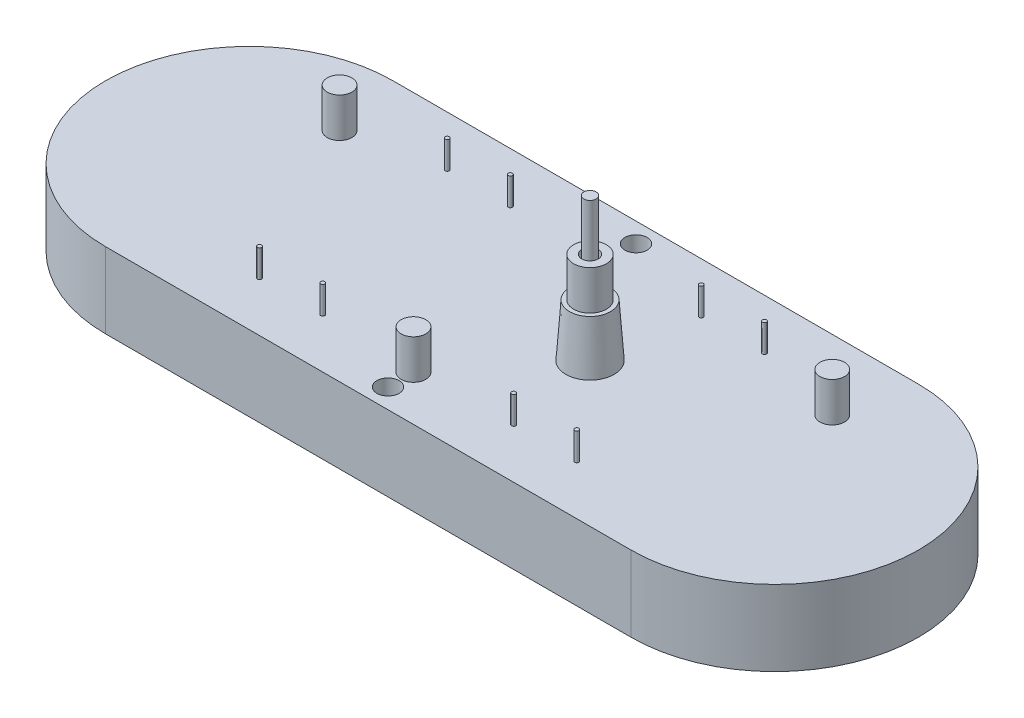
ISO-10303-21;
HEADER;
FILE_DESCRIPTION(('STEP AP214'),'2;1');
FILE_NAME('part.step','',(''),(''),'','','');
FILE_SCHEMA(('AUTOMOTIVE_DESIGN { 1 0 10303 214 1 1 1 1 }'));
ENDSEC;
DATA;
#1=APPLICATION_CONTEXT('core data for automotive mechanical design processes');
#2=APPLICATION_PROTOCOL_DEFINITION('international standard','automotive_design',2000,#1);
#3=PRODUCT_CONTEXT('',#1,'mechanical');
#4=PRODUCT('Part','Part','',(#3));
#5=PRODUCT_RELATED_PRODUCT_CATEGORY('part','',(#4));
#6=PRODUCT_DEFINITION_FORMATION('','',#4);
#7=PRODUCT_DEFINITION_CONTEXT('part definition',#1,'design');
#8=PRODUCT_DEFINITION('design','',#6,#7);
#9=PRODUCT_DEFINITION_SHAPE('','',#8);
#10=(LENGTH_UNIT() NAMED_UNIT(*) SI_UNIT(.MILLI.,.METRE.));
#11=(NAMED_UNIT(*) PLANE_ANGLE_UNIT() SI_UNIT($,.RADIAN.));
#12=(NAMED_UNIT(*) SI_UNIT($,.STERADIAN.) SOLID_ANGLE_UNIT());
#13=UNCERTAINTY_MEASURE_WITH_UNIT(LENGTH_MEASURE(1.E-05),#10,'distance_accuracy_value','');
#14=(GEOMETRIC_REPRESENTATION_CONTEXT(3) GLOBAL_UNCERTAINTY_ASSIGNED_CONTEXT((#13)) GLOBAL_UNIT_ASSIGNED_CONTEXT((#10,
#11,#12)) REPRESENTATION_CONTEXT('',''));
#15=CARTESIAN_POINT('',(0.,0.,0.));
#16=DIRECTION('',(0.,0.,1.));
#17=DIRECTION('',(1.,0.,0.));
#18=AXIS2_PLACEMENT_3D('',#15,#16,#17);
#19=CARTESIAN_POINT('',(-32.,0.,0.));
#20=DIRECTION('',(0.,1.,0.));
#21=DIRECTION('',(0.,0.,1.));
#22=AXIS2_PLACEMENT_3D('',#19,#20,#21);
#23=PLANE('',#22);
#24=CARTESIAN_POINT('',(9.5,0.,0.));
#25=DIRECTION('',(0.,1.,0.));
#26=DIRECTION('',(0.,0.,1.));
#27=AXIS2_PLACEMENT_3D('',#24,#25,#26);
#28=CIRCLE('',#27,1.);
#29=CARTESIAN_POINT('',(9.5,0.,1.));
#30=VERTEX_POINT('',#29);
#31=EDGE_CURVE('E11',#30,#30,#28,.F.);
#32=ORIENTED_EDGE('',*,*,#31,.F.);
#33=EDGE_LOOP('',(#32));
#34=FACE_BOUND('',#33,.T.);
#35=CARTESIAN_POINT('',(9.5,0.,0.));
#36=DIRECTION('',(0.,1.,0.));
#37=DIRECTION('',(0.,0.,1.));
#38=AXIS2_PLACEMENT_3D('',#35,#36,#37);
#39=CIRCLE('',#38,0.750000000000002);
#40=CARTESIAN_POINT('',(9.5,0.,0.750000000000002));
#41=VERTEX_POINT('',#40);
#42=EDGE_CURVE('E117',#41,#41,#39,.T.);
#43=ORIENTED_EDGE('',*,*,#42,.F.);
#44=EDGE_LOOP('',(#43));
#45=FACE_BOUND('',#44,.T.);
#46=ADVANCED_FACE('F38',(#34,#45),#23,.T.);
#47=CARTESIAN_POINT('',(9.5,17.4,0.));
#48=DIRECTION('',(0.,1.,0.));
#49=DIRECTION('',(0.,0.,1.));
#50=AXIS2_PLACEMENT_3D('',#47,#48,#49);
#51=PLANE('',#50);
#52=CARTESIAN_POINT('',(9.5,17.4,0.));
#53=DIRECTION('',(0.,-1.,0.));
#54=DIRECTION('',(0.,0.,-1.));
#55=AXIS2_PLACEMENT_3D('',#52,#53,#54);
#56=CIRCLE('',#55,0.75);
#57=CARTESIAN_POINT('',(9.5,17.4,-0.75));
#58=VERTEX_POINT('',#57);
#59=EDGE_CURVE('E111',#58,#58,#56,.T.);
#60=ORIENTED_EDGE('',*,*,#59,.F.);
#61=EDGE_LOOP('',(#60));
#62=FACE_BOUND('',#61,.T.);
#63=ADVANCED_FACE('F144',(#62),#51,.T.);
#64=CARTESIAN_POINT('',(9.5,0.,0.));
#65=DIRECTION('',(0.,-1.,0.));
#66=DIRECTION('',(0.,0.,-1.));
#67=AXIS2_PLACEMENT_3D('',#64,#65,#66);
#68=CYLINDRICAL_SURFACE('',#67,0.750000000000002);
#69=ORIENTED_EDGE('',*,*,#59,.T.);
#70=EDGE_LOOP('',(#69));
#71=FACE_BOUND('',#70,.T.);
#72=ORIENTED_EDGE('',*,*,#42,.T.);
#73=EDGE_LOOP('',(#72));
#74=FACE_BOUND('',#73,.T.);
#75=ADVANCED_FACE('F149',(#71,#74),#68,.T.);
#76=CARTESIAN_POINT('',(9.5,0.,0.));
#77=DIRECTION('',(0.,-1.,0.));
#78=DIRECTION('',(0.,0.,-1.));
#79=AXIS2_PLACEMENT_3D('',#76,#77,#78);
#80=CYLINDRICAL_SURFACE('',#79,1.);
#81=ORIENTED_EDGE('',*,*,#31,.T.);
#82=EDGE_LOOP('',(#81));
#83=FACE_BOUND('',#82,.T.);
#84=CARTESIAN_POINT('',(9.5,11.2,0.));
#85=DIRECTION('',(0.,-1.,0.));
#86=DIRECTION('',(0.,0.,-1.));
#87=AXIS2_PLACEMENT_3D('',#84,#85,#86);
#88=CIRCLE('',#87,1.);
#89=CARTESIAN_POINT('',(9.5,11.2,-1.));
#90=VERTEX_POINT('',#89);
#91=EDGE_CURVE('E352',#90,#90,#88,.T.);
#92=ORIENTED_EDGE('',*,*,#91,.F.);
#93=EDGE_LOOP('',(#92));
#94=FACE_BOUND('',#93,.T.);
#95=ADVANCED_FACE('F157',(#83,#94),#80,.F.);
#96=CARTESIAN_POINT('',(9.5,0.,0.));
#97=DIRECTION('',(0.,-1.,0.));
#98=DIRECTION('',(0.,0.,-1.));
#99=AXIS2_PLACEMENT_3D('',#96,#97,#98);
#100=CONICAL_SURFACE('',#99,2.94753159643842,0.0698131700797663);
#101=CARTESIAN_POINT('',(9.5,6.4,0.));
#102=DIRECTION('',(0.,-1.,0.));
#103=DIRECTION('',(0.,0.,-1.));
#104=AXIS2_PLACEMENT_3D('',#101,#102,#103);
#105=CIRCLE('',#104,2.5);
#106=CARTESIAN_POINT('',(9.5,6.4,-2.5));
#107=VERTEX_POINT('',#106);
#108=EDGE_CURVE('E363',#107,#107,#105,.T.);
#109=ORIENTED_EDGE('',*,*,#108,.T.);
#110=EDGE_LOOP('',(#109));
#111=FACE_BOUND('',#110,.T.);
#112=CARTESIAN_POINT('',(9.5,0.,0.));
#113=DIRECTION('',(0.,1.,0.));
#114=DIRECTION('',(0.,0.,1.));
#115=AXIS2_PLACEMENT_3D('',#112,#113,#114);
#116=CIRCLE('',#115,2.94753159643842);
#117=CARTESIAN_POINT('',(9.5,0.,2.94753159643842));
#118=VERTEX_POINT('',#117);
#119=EDGE_CURVE('E47',#118,#118,#116,.T.);
#120=ORIENTED_EDGE('',*,*,#119,.T.);
#121=EDGE_LOOP('',(#120));
#122=FACE_BOUND('',#121,.T.);
#123=ADVANCED_FACE('F124',(#111,#122),#100,.T.);
#124=CARTESIAN_POINT('',(9.5,6.4,-2.5));
#125=DIRECTION('',(0.,1.,0.));
#126=DIRECTION('',(0.,0.,1.));
#127=AXIS2_PLACEMENT_3D('',#124,#125,#126);
#128=PLANE('',#127);
#129=CARTESIAN_POINT('',(9.5,6.4,0.));
#130=DIRECTION('',(0.,-1.,0.));
#131=DIRECTION('',(0.,0.,-1.));
#132=AXIS2_PLACEMENT_3D('',#129,#130,#131);
#133=CIRCLE('',#132,2.);
#134=CARTESIAN_POINT('',(9.5,6.4,-2.));
#135=VERTEX_POINT('',#134);
#136=EDGE_CURVE('E360',#135,#135,#133,.T.);
#137=ORIENTED_EDGE('',*,*,#136,.T.);
#138=EDGE_LOOP('',(#137));
#139=FACE_BOUND('',#138,.T.);
#140=ORIENTED_EDGE('',*,*,#108,.F.);
#141=EDGE_LOOP('',(#140));
#142=FACE_BOUND('',#141,.T.);
#143=ADVANCED_FACE('F164',(#139,#142),#128,.T.);
#144=CARTESIAN_POINT('',(9.5,0.,0.));
#145=DIRECTION('',(0.,-1.,0.));
#146=DIRECTION('',(0.,0.,-1.));
#147=AXIS2_PLACEMENT_3D('',#144,#145,#146);
#148=CYLINDRICAL_SURFACE('',#147,2.);
#149=CARTESIAN_POINT('',(9.5,11.2,0.));
#150=DIRECTION('',(0.,-1.,0.));
#151=DIRECTION('',(0.,0.,-1.));
#152=AXIS2_PLACEMENT_3D('',#149,#150,#151);
#153=CIRCLE('',#152,2.);
#154=CARTESIAN_POINT('',(9.5,11.2,-2.));
#155=VERTEX_POINT('',#154);
#156=EDGE_CURVE('E357',#155,#155,#153,.T.);
#157=ORIENTED_EDGE('',*,*,#156,.T.);
#158=EDGE_LOOP('',(#157));
#159=FACE_BOUND('',#158,.T.);
#160=ORIENTED_EDGE('',*,*,#136,.F.);
#161=EDGE_LOOP('',(#160));
#162=FACE_BOUND('',#161,.T.);
#163=ADVANCED_FACE('F168',(#159,#162),#148,.T.);
#164=CARTESIAN_POINT('',(9.5,11.2,-2.));
#165=DIRECTION('',(0.,1.,0.));
#166=DIRECTION('',(0.,0.,1.));
#167=AXIS2_PLACEMENT_3D('',#164,#165,#166);
#168=PLANE('',#167);
#169=ORIENTED_EDGE('',*,*,#91,.T.);
#170=EDGE_LOOP('',(#169));
#171=FACE_BOUND('',#170,.T.);
#172=ORIENTED_EDGE('',*,*,#156,.F.);
#173=EDGE_LOOP('',(#172));
#174=FACE_BOUND('',#173,.T.);
#175=ADVANCED_FACE('F140',(#171,#174),#168,.T.);
#176=CARTESIAN_POINT('',(-32.,-9.2,0.));
#177=DIRECTION('',(0.,1.,0.));
#178=DIRECTION('',(0.,0.,1.));
#179=AXIS2_PLACEMENT_3D('',#176,#177,#178);
#180=PLANE('',#179);
#181=CARTESIAN_POINT('',(0.,-9.2,-15.1));
#182=DIRECTION('',(0.,1.,0.));
#183=DIRECTION('',(0.,0.,1.));
#184=AXIS2_PLACEMENT_3D('',#181,#182,#183);
#185=CIRCLE('',#184,1.35);
#186=CARTESIAN_POINT('',(0.,-9.2,-13.75));
#187=VERTEX_POINT('',#186);
#188=EDGE_CURVE('E275',#187,#187,#185,.T.);
#189=ORIENTED_EDGE('',*,*,#188,.T.);
#190=EDGE_LOOP('',(#189));
#191=FACE_BOUND('',#190,.T.);
#192=CARTESIAN_POINT('',(0.,-9.2,15.1));
#193=DIRECTION('',(0.,1.,0.));
#194=DIRECTION('',(0.,0.,1.));
#195=AXIS2_PLACEMENT_3D('',#192,#193,#194);
#196=CIRCLE('',#195,1.35);
#197=CARTESIAN_POINT('',(0.,-9.2,16.45));
#198=VERTEX_POINT('',#197);
#199=EDGE_CURVE('E279',#198,#198,#196,.T.);
#200=ORIENTED_EDGE('',*,*,#199,.T.);
#201=EDGE_LOOP('',(#200));
#202=FACE_BOUND('',#201,.T.);
#203=CARTESIAN_POINT('',(-32.,-9.2,0.));
#204=DIRECTION('',(0.,1.,0.));
#205=DIRECTION('',(0.,0.,1.));
#206=AXIS2_PLACEMENT_3D('',#203,#204,#205);
#207=CIRCLE('',#206,17.5);
#208=CARTESIAN_POINT('',(-32.,-9.2,-17.5));
#209=VERTEX_POINT('',#208);
#210=CARTESIAN_POINT('',(-32.,-9.2,17.5));
#211=VERTEX_POINT('',#210);
#212=EDGE_CURVE('E100',#209,#211,#207,.T.);
#213=ORIENTED_EDGE('',*,*,#212,.F.);
#214=DIRECTION('',(-1.,0.,0.));
#215=VECTOR('',#214,1.);
#216=CARTESIAN_POINT('',(-32.,-9.2,-17.5));
#217=LINE('',#216,#215);
#218=CARTESIAN_POINT('',(32.,-9.2,-17.5));
#219=VERTEX_POINT('',#218);
#220=EDGE_CURVE('E97',#219,#209,#217,.T.);
#221=ORIENTED_EDGE('',*,*,#220,.F.);
#222=CARTESIAN_POINT('',(32.,-9.2,0.));
#223=DIRECTION('',(0.,1.,0.));
#224=DIRECTION('',(0.,0.,1.));
#225=AXIS2_PLACEMENT_3D('',#222,#223,#224);
#226=CIRCLE('',#225,17.5);
#227=CARTESIAN_POINT('',(32.,-9.2,17.5));
#228=VERTEX_POINT('',#227);
#229=EDGE_CURVE('E89',#228,#219,#226,.T.);
#230=ORIENTED_EDGE('',*,*,#229,.F.);
#231=DIRECTION('',(1.,0.,0.));
#232=VECTOR('',#231,1.);
#233=CARTESIAN_POINT('',(-32.,-9.2,17.5));
#234=LINE('',#233,#232);
#235=EDGE_CURVE('E96',#211,#228,#234,.T.);
#236=ORIENTED_EDGE('',*,*,#235,.F.);
#237=EDGE_LOOP('',(#213,#221,#230,#236));
#238=FACE_BOUND('',#237,.T.);
#239=ADVANCED_FACE('F95',(#191,#202,#238),#180,.F.);
#240=CARTESIAN_POINT('',(-32.,-9.2,-17.5));
#241=DIRECTION('',(0.,0.,-1.));
#242=DIRECTION('',(-1.,0.,0.));
#243=AXIS2_PLACEMENT_3D('',#240,#241,#242);
#244=PLANE('',#243);
#245=DIRECTION('',(-1.,0.,0.));
#246=VECTOR('',#245,1.);
#247=CARTESIAN_POINT('',(-32.,0.,-17.5));
#248=LINE('',#247,#246);
#249=CARTESIAN_POINT('',(32.,0.,-17.5));
#250=VERTEX_POINT('',#249);
#251=CARTESIAN_POINT('',(-32.,0.,-17.5));
#252=VERTEX_POINT('',#251);
#253=EDGE_CURVE('E102',#250,#252,#248,.T.);
#254=ORIENTED_EDGE('',*,*,#253,.F.);
#255=DIRECTION('',(0.,1.,0.));
#256=VECTOR('',#255,1.);
#257=CARTESIAN_POINT('',(32.,-9.2,-17.5));
#258=LINE('',#257,#256);
#259=EDGE_CURVE('E72',#219,#250,#258,.T.);
#260=ORIENTED_EDGE('',*,*,#259,.F.);
#261=ORIENTED_EDGE('',*,*,#220,.T.);
#262=DIRECTION('',(0.,1.,0.));
#263=VECTOR('',#262,1.);
#264=CARTESIAN_POINT('',(-32.,-9.2,-17.5));
#265=LINE('',#264,#263);
#266=EDGE_CURVE('E55',#209,#252,#265,.T.);
#267=ORIENTED_EDGE('',*,*,#266,.T.);
#268=EDGE_LOOP('',(#254,#260,#261,#267));
#269=FACE_BOUND('',#268,.T.);
#270=ADVANCED_FACE('F132',(#269),#244,.T.);
#271=CARTESIAN_POINT('',(32.,-9.2,0.));
#272=DIRECTION('',(0.,1.,0.));
#273=DIRECTION('',(0.,0.,1.));
#274=AXIS2_PLACEMENT_3D('',#271,#272,#273);
#275=CYLINDRICAL_SURFACE('',#274,17.5);
#276=CARTESIAN_POINT('',(32.,0.,0.));
#277=DIRECTION('',(0.,1.,0.));
#278=DIRECTION('',(0.,0.,1.));
#279=AXIS2_PLACEMENT_3D('',#276,#277,#278);
#280=CIRCLE('',#279,17.5);
#281=CARTESIAN_POINT('',(32.,0.,17.5));
#282=VERTEX_POINT('',#281);
#283=EDGE_CURVE('E91',#282,#250,#280,.T.);
#284=ORIENTED_EDGE('',*,*,#283,.F.);
#285=DIRECTION('',(0.,1.,0.));
#286=VECTOR('',#285,1.);
#287=CARTESIAN_POINT('',(32.,-9.2,17.5));
#288=LINE('',#287,#286);
#289=EDGE_CURVE('E86',#228,#282,#288,.T.);
#290=ORIENTED_EDGE('',*,*,#289,.F.);
#291=ORIENTED_EDGE('',*,*,#229,.T.);
#292=ORIENTED_EDGE('',*,*,#259,.T.);
#293=EDGE_LOOP('',(#284,#290,#291,#292));
#294=FACE_BOUND('',#293,.T.);
#295=ADVANCED_FACE('F88',(#294),#275,.T.);
#296=CARTESIAN_POINT('',(-32.,-9.2,17.5));
#297=DIRECTION('',(0.,0.,1.));
#298=DIRECTION('',(1.,0.,0.));
#299=AXIS2_PLACEMENT_3D('',#296,#297,#298);
#300=PLANE('',#299);
#301=DIRECTION('',(1.,0.,0.));
#302=VECTOR('',#301,1.);
#303=CARTESIAN_POINT('',(-32.,0.,17.5));
#304=LINE('',#303,#302);
#305=CARTESIAN_POINT('',(-32.,0.,17.5));
#306=VERTEX_POINT('',#305);
#307=EDGE_CURVE('E110',#306,#282,#304,.T.);
#308=ORIENTED_EDGE('',*,*,#307,.F.);
#309=DIRECTION('',(0.,1.,0.));
#310=VECTOR('',#309,1.);
#311=CARTESIAN_POINT('',(-32.,-9.2,17.5));
#312=LINE('',#311,#310);
#313=EDGE_CURVE('E83',#211,#306,#312,.T.);
#314=ORIENTED_EDGE('',*,*,#313,.F.);
#315=ORIENTED_EDGE('',*,*,#235,.T.);
#316=ORIENTED_EDGE('',*,*,#289,.T.);
#317=EDGE_LOOP('',(#308,#314,#315,#316));
#318=FACE_BOUND('',#317,.T.);
#319=ADVANCED_FACE('F99',(#318),#300,.T.);
#320=CARTESIAN_POINT('',(-32.,-9.2,0.));
#321=DIRECTION('',(0.,1.,0.));
#322=DIRECTION('',(0.,0.,1.));
#323=AXIS2_PLACEMENT_3D('',#320,#321,#322);
#324=CYLINDRICAL_SURFACE('',#323,17.5);
#325=CARTESIAN_POINT('',(-32.,0.,0.));
#326=DIRECTION('',(0.,1.,0.));
#327=DIRECTION('',(0.,0.,1.));
#328=AXIS2_PLACEMENT_3D('',#325,#326,#327);
#329=CIRCLE('',#328,17.5);
#330=EDGE_CURVE('E107',#252,#306,#329,.T.);
#331=ORIENTED_EDGE('',*,*,#330,.F.);
#332=ORIENTED_EDGE('',*,*,#266,.F.);
#333=ORIENTED_EDGE('',*,*,#212,.T.);
#334=ORIENTED_EDGE('',*,*,#313,.T.);
#335=EDGE_LOOP('',(#331,#332,#333,#334));
#336=FACE_BOUND('',#335,.T.);
#337=ADVANCED_FACE('F40',(#336),#324,.T.);
#338=CARTESIAN_POINT('',(0.,0.,-15.1));
#339=DIRECTION('',(0.,1.,0.));
#340=DIRECTION('',(0.,0.,1.));
#341=AXIS2_PLACEMENT_3D('',#338,#339,#340);
#342=CIRCLE('',#341,1.35);
#343=CARTESIAN_POINT('',(0.,0.,-13.75));
#344=VERTEX_POINT('',#343);
#345=EDGE_CURVE('E278',#344,#344,#342,.T.);
#346=ORIENTED_EDGE('',*,*,#345,.F.);
#347=EDGE_LOOP('',(#346));
#348=FACE_BOUND('',#347,.T.);
#349=CARTESIAN_POINT('',(0.,0.,15.1));
#350=DIRECTION('',(0.,1.,0.));
#351=DIRECTION('',(0.,0.,1.));
#352=AXIS2_PLACEMENT_3D('',#349,#350,#351);
#353=CIRCLE('',#352,1.35);
#354=CARTESIAN_POINT('',(0.,0.,16.45));
#355=VERTEX_POINT('',#354);
#356=EDGE_CURVE('E284',#355,#355,#353,.T.);
#357=ORIENTED_EDGE('',*,*,#356,.F.);
#358=EDGE_LOOP('',(#357));
#359=FACE_BOUND('',#358,.T.);
#360=CARTESIAN_POINT('',(19.32,0.,-11.425));
#361=DIRECTION('',(0.,1.,0.));
#362=DIRECTION('',(0.,0.,-1.));
#363=AXIS2_PLACEMENT_3D('',#360,#361,#362);
#364=CIRCLE('',#363,0.25);
#365=CARTESIAN_POINT('',(19.32,0.,-11.675));
#366=VERTEX_POINT('',#365);
#367=EDGE_CURVE('E281',#366,#366,#364,.T.);
#368=ORIENTED_EDGE('',*,*,#367,.F.);
#369=EDGE_LOOP('',(#368));
#370=FACE_BOUND('',#369,.T.);
#371=CARTESIAN_POINT('',(11.62,0.,-11.425));
#372=DIRECTION('',(0.,1.,0.));
#373=DIRECTION('',(0.,0.,-1.));
#374=AXIS2_PLACEMENT_3D('',#371,#372,#373);
#375=CIRCLE('',#374,0.25);
#376=CARTESIAN_POINT('',(11.62,0.,-11.675));
#377=VERTEX_POINT('',#376);
#378=EDGE_CURVE('E292',#377,#377,#375,.T.);
#379=ORIENTED_EDGE('',*,*,#378,.F.);
#380=EDGE_LOOP('',(#379));
#381=FACE_BOUND('',#380,.T.);
#382=CARTESIAN_POINT('',(11.6199999999998,0.,11.425));
#383=DIRECTION('',(0.,1.,0.));
#384=DIRECTION('',(0.,0.,-1.));
#385=AXIS2_PLACEMENT_3D('',#382,#383,#384);
#386=CIRCLE('',#385,0.25);
#387=CARTESIAN_POINT('',(11.6199999999998,0.,11.175));
#388=VERTEX_POINT('',#387);
#389=EDGE_CURVE('E298',#388,#388,#386,.T.);
#390=ORIENTED_EDGE('',*,*,#389,.F.);
#391=EDGE_LOOP('',(#390));
#392=FACE_BOUND('',#391,.T.);
#393=CARTESIAN_POINT('',(19.3199999999998,0.,11.425));
#394=DIRECTION('',(0.,1.,0.));
#395=DIRECTION('',(0.,0.,-1.));
#396=AXIS2_PLACEMENT_3D('',#393,#394,#395);
#397=CIRCLE('',#396,0.25);
#398=CARTESIAN_POINT('',(19.3199999999998,0.,11.175));
#399=VERTEX_POINT('',#398);
#400=EDGE_CURVE('E304',#399,#399,#397,.T.);
#401=ORIENTED_EDGE('',*,*,#400,.F.);
#402=EDGE_LOOP('',(#401));
#403=FACE_BOUND('',#402,.T.);
#404=CARTESIAN_POINT('',(-19.3199999999998,0.,11.425));
#405=DIRECTION('',(0.,1.,0.));
#406=DIRECTION('',(0.,0.,1.));
#407=AXIS2_PLACEMENT_3D('',#404,#405,#406);
#408=CIRCLE('',#407,0.25);
#409=CARTESIAN_POINT('',(-19.3199999999998,0.,11.675));
#410=VERTEX_POINT('',#409);
#411=EDGE_CURVE('E310',#410,#410,#408,.T.);
#412=ORIENTED_EDGE('',*,*,#411,.F.);
#413=EDGE_LOOP('',(#412));
#414=FACE_BOUND('',#413,.T.);
#415=CARTESIAN_POINT('',(-11.6199999999998,0.,11.425));
#416=DIRECTION('',(0.,1.,0.));
#417=DIRECTION('',(0.,0.,1.));
#418=AXIS2_PLACEMENT_3D('',#415,#416,#417);
#419=CIRCLE('',#418,0.25);
#420=CARTESIAN_POINT('',(-11.6199999999998,0.,11.675));
#421=VERTEX_POINT('',#420);
#422=EDGE_CURVE('E316',#421,#421,#419,.T.);
#423=ORIENTED_EDGE('',*,*,#422,.F.);
#424=EDGE_LOOP('',(#423));
#425=FACE_BOUND('',#424,.T.);
#426=CARTESIAN_POINT('',(-11.62,0.,-11.425));
#427=DIRECTION('',(0.,1.,0.));
#428=DIRECTION('',(0.,0.,1.));
#429=AXIS2_PLACEMENT_3D('',#426,#427,#428);
#430=CIRCLE('',#429,0.25);
#431=CARTESIAN_POINT('',(-11.62,0.,-11.175));
#432=VERTEX_POINT('',#431);
#433=EDGE_CURVE('E322',#432,#432,#430,.T.);
#434=ORIENTED_EDGE('',*,*,#433,.F.);
#435=EDGE_LOOP('',(#434));
#436=FACE_BOUND('',#435,.T.);
#437=CARTESIAN_POINT('',(-19.32,0.,-11.425));
#438=DIRECTION('',(0.,1.,0.));
#439=DIRECTION('',(0.,0.,1.));
#440=AXIS2_PLACEMENT_3D('',#437,#438,#439);
#441=CIRCLE('',#440,0.25);
#442=CARTESIAN_POINT('',(-19.32,0.,-11.175));
#443=VERTEX_POINT('',#442);
#444=EDGE_CURVE('E328',#443,#443,#441,.T.);
#445=ORIENTED_EDGE('',*,*,#444,.F.);
#446=EDGE_LOOP('',(#445));
#447=FACE_BOUND('',#446,.T.);
#448=CARTESIAN_POINT('',(-30.,0.,-9.));
#449=DIRECTION('',(0.,1.,0.));
#450=DIRECTION('',(0.,0.,-1.));
#451=AXIS2_PLACEMENT_3D('',#448,#449,#450);
#452=CIRCLE('',#451,1.50000000000001);
#453=CARTESIAN_POINT('',(-30.,0.,-10.5));
#454=VERTEX_POINT('',#453);
#455=EDGE_CURVE('E334',#454,#454,#452,.T.);
#456=ORIENTED_EDGE('',*,*,#455,.F.);
#457=EDGE_LOOP('',(#456));
#458=FACE_BOUND('',#457,.T.);
#459=CARTESIAN_POINT('',(30.,0.,-9.));
#460=DIRECTION('',(0.,1.,0.));
#461=DIRECTION('',(0.,0.,1.));
#462=AXIS2_PLACEMENT_3D('',#459,#460,#461);
#463=CIRCLE('',#462,1.50000000000001);
#464=CARTESIAN_POINT('',(30.,0.,-7.49999999999999));
#465=VERTEX_POINT('',#464);
#466=EDGE_CURVE('E340',#465,#465,#463,.T.);
#467=ORIENTED_EDGE('',*,*,#466,.F.);
#468=EDGE_LOOP('',(#467));
#469=FACE_BOUND('',#468,.T.);
#470=CARTESIAN_POINT('',(0.,0.,12.));
#471=DIRECTION('',(0.,1.,0.));
#472=DIRECTION('',(0.,0.,1.));
#473=AXIS2_PLACEMENT_3D('',#470,#471,#472);
#474=CIRCLE('',#473,1.5);
#475=CARTESIAN_POINT('',(0.,0.,13.5));
#476=VERTEX_POINT('',#475);
#477=EDGE_CURVE('E346',#476,#476,#474,.T.);
#478=ORIENTED_EDGE('',*,*,#477,.F.);
#479=EDGE_LOOP('',(#478));
#480=FACE_BOUND('',#479,.T.);
#481=ORIENTED_EDGE('',*,*,#119,.F.);
#482=EDGE_LOOP('',(#481));
#483=FACE_BOUND('',#482,.T.);
#484=ORIENTED_EDGE('',*,*,#330,.T.);
#485=ORIENTED_EDGE('',*,*,#307,.T.);
#486=ORIENTED_EDGE('',*,*,#283,.T.);
#487=ORIENTED_EDGE('',*,*,#253,.T.);
#488=EDGE_LOOP('',(#484,#485,#486,#487));
#489=FACE_BOUND('',#488,.T.);
#490=ADVANCED_FACE('F126',(#348,#359,#370,#381,#392,#403,#414,#425,#436,#447,#458,#469,#480,
#483,#489),#23,.T.);
#491=CARTESIAN_POINT('',(0.,4.8,12.));
#492=DIRECTION('',(0.,-1.,0.));
#493=DIRECTION('',(0.,0.,-1.));
#494=AXIS2_PLACEMENT_3D('',#491,#492,#493);
#495=CYLINDRICAL_SURFACE('',#494,1.5);
#496=CARTESIAN_POINT('',(0.,4.8,12.));
#497=DIRECTION('',(0.,1.,0.));
#498=DIRECTION('',(0.,0.,1.));
#499=AXIS2_PLACEMENT_3D('',#496,#497,#498);
#500=CIRCLE('',#499,1.5);
#501=CARTESIAN_POINT('',(0.,4.8,13.5));
#502=VERTEX_POINT('',#501);
#503=EDGE_CURVE('E349',#502,#502,#500,.T.);
#504=ORIENTED_EDGE('',*,*,#503,.F.);
#505=EDGE_LOOP('',(#504));
#506=FACE_BOUND('',#505,.T.);
#507=ORIENTED_EDGE('',*,*,#477,.T.);
#508=EDGE_LOOP('',(#507));
#509=FACE_BOUND('',#508,.T.);
#510=ADVANCED_FACE('F129',(#506,#509),#495,.T.);
#511=CARTESIAN_POINT('',(0.,4.8,12.));
#512=DIRECTION('',(0.,1.,0.));
#513=DIRECTION('',(0.,0.,1.));
#514=AXIS2_PLACEMENT_3D('',#511,#512,#513);
#515=PLANE('',#514);
#516=ORIENTED_EDGE('',*,*,#503,.T.);
#517=EDGE_LOOP('',(#516));
#518=FACE_BOUND('',#517,.T.);
#519=ADVANCED_FACE('F178',(#518),#515,.T.);
#520=CARTESIAN_POINT('',(30.,4.8,-9.));
#521=DIRECTION('',(0.,-1.,0.));
#522=DIRECTION('',(0.,0.,-1.));
#523=AXIS2_PLACEMENT_3D('',#520,#521,#522);
#524=CYLINDRICAL_SURFACE('',#523,1.50000000000001);
#525=CARTESIAN_POINT('',(30.,4.8,-9.));
#526=DIRECTION('',(0.,1.,0.));
#527=DIRECTION('',(0.,0.,1.));
#528=AXIS2_PLACEMENT_3D('',#525,#526,#527);
#529=CIRCLE('',#528,1.50000000000001);
#530=CARTESIAN_POINT('',(30.,4.8,-7.49999999999999));
#531=VERTEX_POINT('',#530);
#532=EDGE_CURVE('E343',#531,#531,#529,.T.);
#533=ORIENTED_EDGE('',*,*,#532,.F.);
#534=EDGE_LOOP('',(#533));
#535=FACE_BOUND('',#534,.T.);
#536=ORIENTED_EDGE('',*,*,#466,.T.);
#537=EDGE_LOOP('',(#536));
#538=FACE_BOUND('',#537,.T.);
#539=ADVANCED_FACE('F182',(#535,#538),#524,.T.);
#540=CARTESIAN_POINT('',(30.,4.8,-9.));
#541=DIRECTION('',(0.,1.,0.));
#542=DIRECTION('',(0.,0.,1.));
#543=AXIS2_PLACEMENT_3D('',#540,#541,#542);
#544=PLANE('',#543);
#545=ORIENTED_EDGE('',*,*,#532,.T.);
#546=EDGE_LOOP('',(#545));
#547=FACE_BOUND('',#546,.T.);
#548=ADVANCED_FACE('F186',(#547),#544,.T.);
#549=CARTESIAN_POINT('',(-30.,4.8,-9.));
#550=DIRECTION('',(0.,-1.,0.));
#551=DIRECTION('',(0.,0.,-1.));
#552=AXIS2_PLACEMENT_3D('',#549,#550,#551);
#553=CYLINDRICAL_SURFACE('',#552,1.50000000000001);
#554=CARTESIAN_POINT('',(-30.,4.8,-9.));
#555=DIRECTION('',(0.,1.,0.));
#556=DIRECTION('',(0.,0.,-1.));
#557=AXIS2_PLACEMENT_3D('',#554,#555,#556);
#558=CIRCLE('',#557,1.50000000000001);
#559=CARTESIAN_POINT('',(-30.,4.8,-10.5));
#560=VERTEX_POINT('',#559);
#561=EDGE_CURVE('E337',#560,#560,#558,.T.);
#562=ORIENTED_EDGE('',*,*,#561,.F.);
#563=EDGE_LOOP('',(#562));
#564=FACE_BOUND('',#563,.T.);
#565=ORIENTED_EDGE('',*,*,#455,.T.);
#566=EDGE_LOOP('',(#565));
#567=FACE_BOUND('',#566,.T.);
#568=ADVANCED_FACE('F190',(#564,#567),#553,.T.);
#569=CARTESIAN_POINT('',(-30.,4.8,-9.));
#570=DIRECTION('',(0.,-1.,0.));
#571=DIRECTION('',(0.,0.,-1.));
#572=AXIS2_PLACEMENT_3D('',#569,#570,#571);
#573=PLANE('',#572);
#574=ORIENTED_EDGE('',*,*,#561,.T.);
#575=EDGE_LOOP('',(#574));
#576=FACE_BOUND('',#575,.T.);
#577=ADVANCED_FACE('F194',(#576),#573,.F.);
#578=CARTESIAN_POINT('',(-19.32,3.35,-11.425));
#579=DIRECTION('',(0.,-1.,0.));
#580=DIRECTION('',(0.,0.,-1.));
#581=AXIS2_PLACEMENT_3D('',#578,#579,#580);
#582=CYLINDRICAL_SURFACE('',#581,0.25);
#583=CARTESIAN_POINT('',(-19.32,3.35,-11.425));
#584=DIRECTION('',(0.,1.,0.));
#585=DIRECTION('',(0.,0.,1.));
#586=AXIS2_PLACEMENT_3D('',#583,#584,#585);
#587=CIRCLE('',#586,0.25);
#588=CARTESIAN_POINT('',(-19.32,3.35,-11.175));
#589=VERTEX_POINT('',#588);
#590=EDGE_CURVE('E331',#589,#589,#587,.T.);
#591=ORIENTED_EDGE('',*,*,#590,.F.);
#592=EDGE_LOOP('',(#591));
#593=FACE_BOUND('',#592,.T.);
#594=ORIENTED_EDGE('',*,*,#444,.T.);
#595=EDGE_LOOP('',(#594));
#596=FACE_BOUND('',#595,.T.);
#597=ADVANCED_FACE('F198',(#593,#596),#582,.T.);
#598=CARTESIAN_POINT('',(-19.32,3.35,-11.425));
#599=DIRECTION('',(0.,1.,0.));
#600=DIRECTION('',(0.,0.,1.));
#601=AXIS2_PLACEMENT_3D('',#598,#599,#600);
#602=PLANE('',#601);
#603=ORIENTED_EDGE('',*,*,#590,.T.);
#604=EDGE_LOOP('',(#603));
#605=FACE_BOUND('',#604,.T.);
#606=ADVANCED_FACE('F202',(#605),#602,.T.);
#607=CARTESIAN_POINT('',(-11.62,3.35,-11.425));
#608=DIRECTION('',(0.,-1.,0.));
#609=DIRECTION('',(0.,0.,-1.));
#610=AXIS2_PLACEMENT_3D('',#607,#608,#609);
#611=CYLINDRICAL_SURFACE('',#610,0.25);
#612=CARTESIAN_POINT('',(-11.62,3.35,-11.425));
#613=DIRECTION('',(0.,1.,0.));
#614=DIRECTION('',(0.,0.,1.));
#615=AXIS2_PLACEMENT_3D('',#612,#613,#614);
#616=CIRCLE('',#615,0.25);
#617=CARTESIAN_POINT('',(-11.62,3.35,-11.175));
#618=VERTEX_POINT('',#617);
#619=EDGE_CURVE('E325',#618,#618,#616,.T.);
#620=ORIENTED_EDGE('',*,*,#619,.F.);
#621=EDGE_LOOP('',(#620));
#622=FACE_BOUND('',#621,.T.);
#623=ORIENTED_EDGE('',*,*,#433,.T.);
#624=EDGE_LOOP('',(#623));
#625=FACE_BOUND('',#624,.T.);
#626=ADVANCED_FACE('F206',(#622,#625),#611,.T.);
#627=CARTESIAN_POINT('',(-11.62,3.35,-11.425));
#628=DIRECTION('',(0.,1.,0.));
#629=DIRECTION('',(0.,0.,1.));
#630=AXIS2_PLACEMENT_3D('',#627,#628,#629);
#631=PLANE('',#630);
#632=ORIENTED_EDGE('',*,*,#619,.T.);
#633=EDGE_LOOP('',(#632));
#634=FACE_BOUND('',#633,.T.);
#635=ADVANCED_FACE('F210',(#634),#631,.T.);
#636=CARTESIAN_POINT('',(-11.6199999999998,3.35,11.425));
#637=DIRECTION('',(0.,-1.,0.));
#638=DIRECTION('',(0.,0.,-1.));
#639=AXIS2_PLACEMENT_3D('',#636,#637,#638);
#640=CYLINDRICAL_SURFACE('',#639,0.25);
#641=CARTESIAN_POINT('',(-11.6199999999998,3.35,11.425));
#642=DIRECTION('',(0.,1.,0.));
#643=DIRECTION('',(0.,0.,1.));
#644=AXIS2_PLACEMENT_3D('',#641,#642,#643);
#645=CIRCLE('',#644,0.25);
#646=CARTESIAN_POINT('',(-11.6199999999998,3.35,11.675));
#647=VERTEX_POINT('',#646);
#648=EDGE_CURVE('E319',#647,#647,#645,.T.);
#649=ORIENTED_EDGE('',*,*,#648,.F.);
#650=EDGE_LOOP('',(#649));
#651=FACE_BOUND('',#650,.T.);
#652=ORIENTED_EDGE('',*,*,#422,.T.);
#653=EDGE_LOOP('',(#652));
#654=FACE_BOUND('',#653,.T.);
#655=ADVANCED_FACE('F214',(#651,#654),#640,.T.);
#656=CARTESIAN_POINT('',(-11.6199999999998,3.35,11.425));
#657=DIRECTION('',(0.,1.,0.));
#658=DIRECTION('',(0.,0.,1.));
#659=AXIS2_PLACEMENT_3D('',#656,#657,#658);
#660=PLANE('',#659);
#661=ORIENTED_EDGE('',*,*,#648,.T.);
#662=EDGE_LOOP('',(#661));
#663=FACE_BOUND('',#662,.T.);
#664=ADVANCED_FACE('F218',(#663),#660,.T.);
#665=CARTESIAN_POINT('',(-19.3199999999998,3.35,11.425));
#666=DIRECTION('',(0.,-1.,0.));
#667=DIRECTION('',(0.,0.,-1.));
#668=AXIS2_PLACEMENT_3D('',#665,#666,#667);
#669=CYLINDRICAL_SURFACE('',#668,0.25);
#670=CARTESIAN_POINT('',(-19.3199999999998,3.35,11.425));
#671=DIRECTION('',(0.,1.,0.));
#672=DIRECTION('',(0.,0.,1.));
#673=AXIS2_PLACEMENT_3D('',#670,#671,#672);
#674=CIRCLE('',#673,0.25);
#675=CARTESIAN_POINT('',(-19.3199999999998,3.35,11.675));
#676=VERTEX_POINT('',#675);
#677=EDGE_CURVE('E313',#676,#676,#674,.T.);
#678=ORIENTED_EDGE('',*,*,#677,.F.);
#679=EDGE_LOOP('',(#678));
#680=FACE_BOUND('',#679,.T.);
#681=ORIENTED_EDGE('',*,*,#411,.T.);
#682=EDGE_LOOP('',(#681));
#683=FACE_BOUND('',#682,.T.);
#684=ADVANCED_FACE('F222',(#680,#683),#669,.T.);
#685=CARTESIAN_POINT('',(-19.3199999999998,3.35,11.425));
#686=DIRECTION('',(0.,1.,0.));
#687=DIRECTION('',(0.,0.,1.));
#688=AXIS2_PLACEMENT_3D('',#685,#686,#687);
#689=PLANE('',#688);
#690=ORIENTED_EDGE('',*,*,#677,.T.);
#691=EDGE_LOOP('',(#690));
#692=FACE_BOUND('',#691,.T.);
#693=ADVANCED_FACE('F226',(#692),#689,.T.);
#694=CARTESIAN_POINT('',(19.3199999999998,3.35,11.425));
#695=DIRECTION('',(0.,-1.,0.));
#696=DIRECTION('',(0.,0.,-1.));
#697=AXIS2_PLACEMENT_3D('',#694,#695,#696);
#698=CYLINDRICAL_SURFACE('',#697,0.25);
#699=CARTESIAN_POINT('',(19.3199999999998,3.35,11.425));
#700=DIRECTION('',(0.,1.,0.));
#701=DIRECTION('',(0.,0.,-1.));
#702=AXIS2_PLACEMENT_3D('',#699,#700,#701);
#703=CIRCLE('',#702,0.25);
#704=CARTESIAN_POINT('',(19.3199999999998,3.35,11.175));
#705=VERTEX_POINT('',#704);
#706=EDGE_CURVE('E307',#705,#705,#703,.T.);
#707=ORIENTED_EDGE('',*,*,#706,.F.);
#708=EDGE_LOOP('',(#707));
#709=FACE_BOUND('',#708,.T.);
#710=ORIENTED_EDGE('',*,*,#400,.T.);
#711=EDGE_LOOP('',(#710));
#712=FACE_BOUND('',#711,.T.);
#713=ADVANCED_FACE('F230',(#709,#712),#698,.T.);
#714=CARTESIAN_POINT('',(19.3199999999998,3.35,11.425));
#715=DIRECTION('',(0.,-1.,0.));
#716=DIRECTION('',(0.,0.,-1.));
#717=AXIS2_PLACEMENT_3D('',#714,#715,#716);
#718=PLANE('',#717);
#719=ORIENTED_EDGE('',*,*,#706,.T.);
#720=EDGE_LOOP('',(#719));
#721=FACE_BOUND('',#720,.T.);
#722=ADVANCED_FACE('F234',(#721),#718,.F.);
#723=CARTESIAN_POINT('',(11.6199999999998,3.35,11.425));
#724=DIRECTION('',(0.,-1.,0.));
#725=DIRECTION('',(0.,0.,-1.));
#726=AXIS2_PLACEMENT_3D('',#723,#724,#725);
#727=CYLINDRICAL_SURFACE('',#726,0.25);
#728=CARTESIAN_POINT('',(11.6199999999998,3.35,11.425));
#729=DIRECTION('',(0.,1.,0.));
#730=DIRECTION('',(0.,0.,-1.));
#731=AXIS2_PLACEMENT_3D('',#728,#729,#730);
#732=CIRCLE('',#731,0.25);
#733=CARTESIAN_POINT('',(11.6199999999998,3.35,11.175));
#734=VERTEX_POINT('',#733);
#735=EDGE_CURVE('E301',#734,#734,#732,.T.);
#736=ORIENTED_EDGE('',*,*,#735,.F.);
#737=EDGE_LOOP('',(#736));
#738=FACE_BOUND('',#737,.T.);
#739=ORIENTED_EDGE('',*,*,#389,.T.);
#740=EDGE_LOOP('',(#739));
#741=FACE_BOUND('',#740,.T.);
#742=ADVANCED_FACE('F238',(#738,#741),#727,.T.);
#743=CARTESIAN_POINT('',(11.6199999999998,3.35,11.425));
#744=DIRECTION('',(0.,-1.,0.));
#745=DIRECTION('',(0.,0.,-1.));
#746=AXIS2_PLACEMENT_3D('',#743,#744,#745);
#747=PLANE('',#746);
#748=ORIENTED_EDGE('',*,*,#735,.T.);
#749=EDGE_LOOP('',(#748));
#750=FACE_BOUND('',#749,.T.);
#751=ADVANCED_FACE('F242',(#750),#747,.F.);
#752=CARTESIAN_POINT('',(11.62,3.35,-11.425));
#753=DIRECTION('',(0.,-1.,0.));
#754=DIRECTION('',(0.,0.,-1.));
#755=AXIS2_PLACEMENT_3D('',#752,#753,#754);
#756=CYLINDRICAL_SURFACE('',#755,0.25);
#757=CARTESIAN_POINT('',(11.62,3.35,-11.425));
#758=DIRECTION('',(0.,1.,0.));
#759=DIRECTION('',(0.,0.,-1.));
#760=AXIS2_PLACEMENT_3D('',#757,#758,#759);
#761=CIRCLE('',#760,0.25);
#762=CARTESIAN_POINT('',(11.62,3.35,-11.675));
#763=VERTEX_POINT('',#762);
#764=EDGE_CURVE('E295',#763,#763,#761,.T.);
#765=ORIENTED_EDGE('',*,*,#764,.F.);
#766=EDGE_LOOP('',(#765));
#767=FACE_BOUND('',#766,.T.);
#768=ORIENTED_EDGE('',*,*,#378,.T.);
#769=EDGE_LOOP('',(#768));
#770=FACE_BOUND('',#769,.T.);
#771=ADVANCED_FACE('F246',(#767,#770),#756,.T.);
#772=CARTESIAN_POINT('',(11.62,3.35,-11.425));
#773=DIRECTION('',(0.,-1.,0.));
#774=DIRECTION('',(0.,0.,-1.));
#775=AXIS2_PLACEMENT_3D('',#772,#773,#774);
#776=PLANE('',#775);
#777=ORIENTED_EDGE('',*,*,#764,.T.);
#778=EDGE_LOOP('',(#777));
#779=FACE_BOUND('',#778,.T.);
#780=ADVANCED_FACE('F250',(#779),#776,.F.);
#781=CARTESIAN_POINT('',(19.32,3.35,-11.425));
#782=DIRECTION('',(0.,-1.,0.));
#783=DIRECTION('',(0.,0.,-1.));
#784=AXIS2_PLACEMENT_3D('',#781,#782,#783);
#785=CYLINDRICAL_SURFACE('',#784,0.25);
#786=CARTESIAN_POINT('',(19.32,3.35,-11.425));
#787=DIRECTION('',(0.,1.,0.));
#788=DIRECTION('',(0.,0.,-1.));
#789=AXIS2_PLACEMENT_3D('',#786,#787,#788);
#790=CIRCLE('',#789,0.25);
#791=CARTESIAN_POINT('',(19.32,3.35,-11.675));
#792=VERTEX_POINT('',#791);
#793=EDGE_CURVE('E289',#792,#792,#790,.T.);
#794=ORIENTED_EDGE('',*,*,#793,.F.);
#795=EDGE_LOOP('',(#794));
#796=FACE_BOUND('',#795,.T.);
#797=ORIENTED_EDGE('',*,*,#367,.T.);
#798=EDGE_LOOP('',(#797));
#799=FACE_BOUND('',#798,.T.);
#800=ADVANCED_FACE('F254',(#796,#799),#785,.T.);
#801=CARTESIAN_POINT('',(19.32,3.35,-11.425));
#802=DIRECTION('',(0.,-1.,0.));
#803=DIRECTION('',(0.,0.,-1.));
#804=AXIS2_PLACEMENT_3D('',#801,#802,#803);
#805=PLANE('',#804);
#806=ORIENTED_EDGE('',*,*,#793,.T.);
#807=EDGE_LOOP('',(#806));
#808=FACE_BOUND('',#807,.T.);
#809=ADVANCED_FACE('F258',(#808),#805,.F.);
#810=CARTESIAN_POINT('',(0.,-9.2,15.1));
#811=DIRECTION('',(0.,1.,0.));
#812=DIRECTION('',(0.,0.,1.));
#813=AXIS2_PLACEMENT_3D('',#810,#811,#812);
#814=CYLINDRICAL_SURFACE('',#813,1.35);
#815=ORIENTED_EDGE('',*,*,#199,.F.);
#816=EDGE_LOOP('',(#815));
#817=FACE_BOUND('',#816,.T.);
#818=ORIENTED_EDGE('',*,*,#356,.T.);
#819=EDGE_LOOP('',(#818));
#820=FACE_BOUND('',#819,.T.);
#821=ADVANCED_FACE('F262',(#817,#820),#814,.F.);
#822=CARTESIAN_POINT('',(0.,-9.2,-15.1));
#823=DIRECTION('',(0.,1.,0.));
#824=DIRECTION('',(0.,0.,1.));
#825=AXIS2_PLACEMENT_3D('',#822,#823,#824);
#826=CYLINDRICAL_SURFACE('',#825,1.35);
#827=ORIENTED_EDGE('',*,*,#188,.F.);
#828=EDGE_LOOP('',(#827));
#829=FACE_BOUND('',#828,.T.);
#830=ORIENTED_EDGE('',*,*,#345,.T.);
#831=EDGE_LOOP('',(#830));
#832=FACE_BOUND('',#831,.T.);
#833=ADVANCED_FACE('F266',(#829,#832),#826,.F.);
#834=CLOSED_SHELL('',(#46,#63,#75,#95,#123,#143,#163,#175,#239,#270,#295,#319,#337,#490,#510,
#519,#539,#548,#568,#577,#597,#606,#626,#635,#655,#664,#684,#693,#713,#722,#742,#751,#771,#780,
#800,#809,#821,#833));
#835=MANIFOLD_SOLID_BREP('B2',#834);
#836=ADVANCED_BREP_SHAPE_REPRESENTATION('',(#18,#835),#14);
#837=SHAPE_DEFINITION_REPRESENTATION(#9,#836);
ENDSEC;
END-ISO-10303-21;
